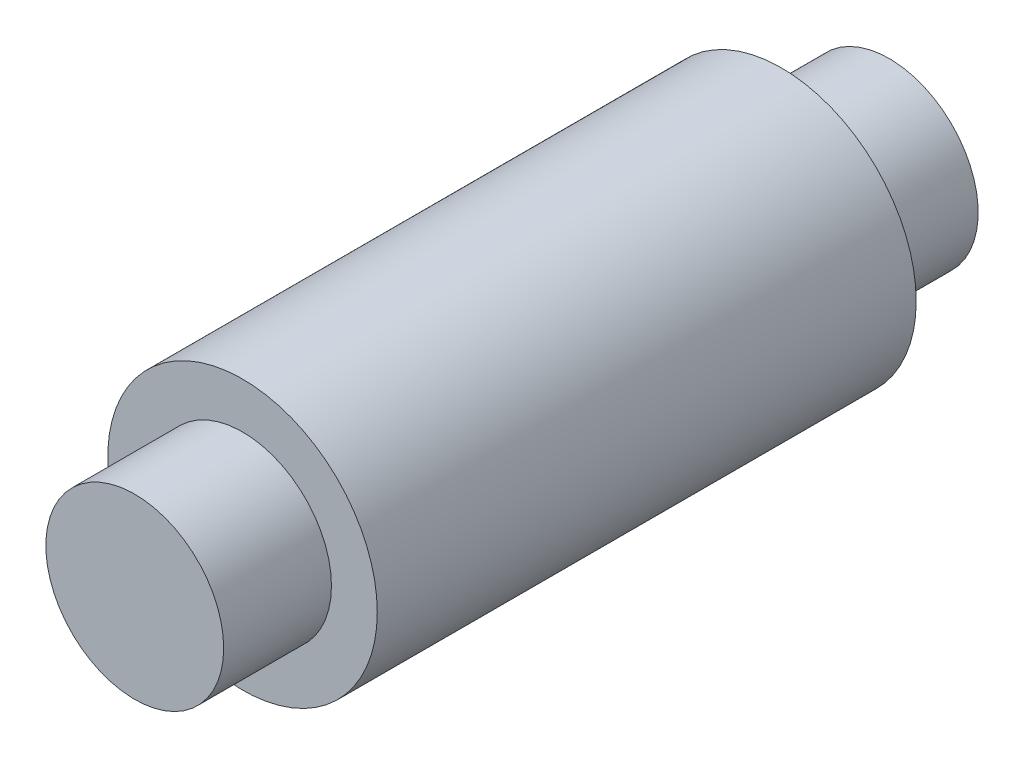
ISO-10303-21;
HEADER;
FILE_DESCRIPTION(('STEP AP214'),'2;1');
FILE_NAME('part.step','',(''),(''),'','','');
FILE_SCHEMA(('AUTOMOTIVE_DESIGN { 1 0 10303 214 1 1 1 1 }'));
ENDSEC;
DATA;
#1=APPLICATION_CONTEXT('core data for automotive mechanical design processes');
#2=APPLICATION_PROTOCOL_DEFINITION('international standard','automotive_design',2000,#1);
#3=PRODUCT_CONTEXT('',#1,'mechanical');
#4=PRODUCT('Part','Part','',(#3));
#5=PRODUCT_RELATED_PRODUCT_CATEGORY('part','',(#4));
#6=PRODUCT_DEFINITION_FORMATION('','',#4);
#7=PRODUCT_DEFINITION_CONTEXT('part definition',#1,'design');
#8=PRODUCT_DEFINITION('design','',#6,#7);
#9=PRODUCT_DEFINITION_SHAPE('','',#8);
#10=(LENGTH_UNIT() NAMED_UNIT(*) SI_UNIT(.MILLI.,.METRE.));
#11=(NAMED_UNIT(*) PLANE_ANGLE_UNIT() SI_UNIT($,.RADIAN.));
#12=(NAMED_UNIT(*) SI_UNIT($,.STERADIAN.) SOLID_ANGLE_UNIT());
#13=UNCERTAINTY_MEASURE_WITH_UNIT(LENGTH_MEASURE(1.E-05),#10,'distance_accuracy_value','');
#14=(GEOMETRIC_REPRESENTATION_CONTEXT(3) GLOBAL_UNCERTAINTY_ASSIGNED_CONTEXT((#13)) GLOBAL_UNIT_ASSIGNED_CONTEXT((#10,
#11,#12)) REPRESENTATION_CONTEXT('',''));
#15=CARTESIAN_POINT('',(0.,0.,0.));
#16=DIRECTION('',(0.,0.,1.));
#17=DIRECTION('',(1.,0.,0.));
#18=AXIS2_PLACEMENT_3D('',#15,#16,#17);
#19=CARTESIAN_POINT('',(0.,0.,10.));
#20=DIRECTION('',(0.,0.,-1.));
#21=DIRECTION('',(-1.,0.,0.));
#22=AXIS2_PLACEMENT_3D('',#19,#20,#21);
#23=CYLINDRICAL_SURFACE('',#22,2.5);
#24=CARTESIAN_POINT('',(0.,0.,10.));
#25=DIRECTION('',(0.,0.,1.));
#26=DIRECTION('',(1.,0.,0.));
#27=AXIS2_PLACEMENT_3D('',#24,#25,#26);
#28=CIRCLE('',#27,2.5);
#29=CARTESIAN_POINT('',(2.5,0.,10.));
#30=VERTEX_POINT('',#29);
#31=EDGE_CURVE('E46',#30,#30,#28,.T.);
#32=ORIENTED_EDGE('',*,*,#31,.F.);
#33=EDGE_LOOP('',(#32));
#34=FACE_BOUND('',#33,.T.);
#35=CARTESIAN_POINT('',(0.,0.,0.));
#36=DIRECTION('',(0.,0.,1.));
#37=DIRECTION('',(1.,0.,0.));
#38=AXIS2_PLACEMENT_3D('',#35,#36,#37);
#39=CIRCLE('',#38,2.5);
#40=CARTESIAN_POINT('',(2.5,0.,0.));
#41=VERTEX_POINT('',#40);
#42=EDGE_CURVE('E37',#41,#41,#39,.T.);
#43=ORIENTED_EDGE('',*,*,#42,.T.);
#44=EDGE_LOOP('',(#43));
#45=FACE_BOUND('',#44,.T.);
#46=ADVANCED_FACE('F34',(#34,#45),#23,.T.);
#47=CARTESIAN_POINT('',(0.,0.,10.));
#48=DIRECTION('',(0.,0.,1.));
#49=DIRECTION('',(1.,0.,0.));
#50=AXIS2_PLACEMENT_3D('',#47,#48,#49);
#51=PLANE('',#50);
#52=CARTESIAN_POINT('',(0.,0.,10.));
#53=DIRECTION('',(0.,0.,1.));
#54=DIRECTION('',(1.,0.,0.));
#55=AXIS2_PLACEMENT_3D('',#52,#53,#54);
#56=CIRCLE('',#55,1.65);
#57=CARTESIAN_POINT('',(1.65,0.,10.));
#58=VERTEX_POINT('',#57);
#59=EDGE_CURVE('E41',#58,#58,#56,.T.);
#60=ORIENTED_EDGE('',*,*,#59,.F.);
#61=EDGE_LOOP('',(#60));
#62=FACE_BOUND('',#61,.T.);
#63=ORIENTED_EDGE('',*,*,#31,.T.);
#64=EDGE_LOOP('',(#63));
#65=FACE_BOUND('',#64,.T.);
#66=ADVANCED_FACE('F63',(#62,#65),#51,.T.);
#67=CARTESIAN_POINT('',(0.,0.,0.));
#68=DIRECTION('',(0.,0.,1.));
#69=DIRECTION('',(1.,0.,0.));
#70=AXIS2_PLACEMENT_3D('',#67,#68,#69);
#71=PLANE('',#70);
#72=CARTESIAN_POINT('',(0.,0.,0.));
#73=DIRECTION('',(0.,0.,-1.));
#74=DIRECTION('',(-1.,0.,0.));
#75=AXIS2_PLACEMENT_3D('',#72,#73,#74);
#76=CIRCLE('',#75,1.65);
#77=CARTESIAN_POINT('',(-1.65,0.,0.));
#78=VERTEX_POINT('',#77);
#79=EDGE_CURVE('E10',#78,#78,#76,.T.);
#80=ORIENTED_EDGE('',*,*,#79,.F.);
#81=EDGE_LOOP('',(#80));
#82=FACE_BOUND('',#81,.T.);
#83=ORIENTED_EDGE('',*,*,#42,.F.);
#84=EDGE_LOOP('',(#83));
#85=FACE_BOUND('',#84,.T.);
#86=ADVANCED_FACE('F60',(#82,#85),#71,.F.);
#87=CARTESIAN_POINT('',(0.,0.,12.));
#88=DIRECTION('',(0.,0.,-1.));
#89=DIRECTION('',(-1.,0.,0.));
#90=AXIS2_PLACEMENT_3D('',#87,#88,#89);
#91=CYLINDRICAL_SURFACE('',#90,1.65);
#92=CARTESIAN_POINT('',(0.,0.,12.));
#93=DIRECTION('',(0.,0.,1.));
#94=DIRECTION('',(1.,0.,0.));
#95=AXIS2_PLACEMENT_3D('',#92,#93,#94);
#96=CIRCLE('',#95,1.65);
#97=CARTESIAN_POINT('',(1.65,0.,12.));
#98=VERTEX_POINT('',#97);
#99=EDGE_CURVE('E51',#98,#98,#96,.T.);
#100=ORIENTED_EDGE('',*,*,#99,.F.);
#101=EDGE_LOOP('',(#100));
#102=FACE_BOUND('',#101,.T.);
#103=ORIENTED_EDGE('',*,*,#59,.T.);
#104=EDGE_LOOP('',(#103));
#105=FACE_BOUND('',#104,.T.);
#106=ADVANCED_FACE('F62',(#102,#105),#91,.T.);
#107=CARTESIAN_POINT('',(0.,0.,12.));
#108=DIRECTION('',(0.,0.,1.));
#109=DIRECTION('',(1.,0.,0.));
#110=AXIS2_PLACEMENT_3D('',#107,#108,#109);
#111=PLANE('',#110);
#112=ORIENTED_EDGE('',*,*,#99,.T.);
#113=EDGE_LOOP('',(#112));
#114=FACE_BOUND('',#113,.T.);
#115=ADVANCED_FACE('F69',(#114),#111,.T.);
#116=CARTESIAN_POINT('',(0.,0.,-2.));
#117=DIRECTION('',(0.,0.,1.));
#118=DIRECTION('',(1.,0.,0.));
#119=AXIS2_PLACEMENT_3D('',#116,#117,#118);
#120=CYLINDRICAL_SURFACE('',#119,1.65);
#121=CARTESIAN_POINT('',(0.,0.,-2.));
#122=DIRECTION('',(0.,0.,-1.));
#123=DIRECTION('',(-1.,0.,0.));
#124=AXIS2_PLACEMENT_3D('',#121,#122,#123);
#125=CIRCLE('',#124,1.65);
#126=CARTESIAN_POINT('',(-1.65,0.,-2.));
#127=VERTEX_POINT('',#126);
#128=EDGE_CURVE('E50',#127,#127,#125,.T.);
#129=ORIENTED_EDGE('',*,*,#128,.F.);
#130=EDGE_LOOP('',(#129));
#131=FACE_BOUND('',#130,.T.);
#132=ORIENTED_EDGE('',*,*,#79,.T.);
#133=EDGE_LOOP('',(#132));
#134=FACE_BOUND('',#133,.T.);
#135=ADVANCED_FACE('F97',(#131,#134),#120,.T.);
#136=CARTESIAN_POINT('',(0.,0.,-2.));
#137=DIRECTION('',(0.,0.,-1.));
#138=DIRECTION('',(-1.,0.,0.));
#139=AXIS2_PLACEMENT_3D('',#136,#137,#138);
#140=PLANE('',#139);
#141=ORIENTED_EDGE('',*,*,#128,.T.);
#142=EDGE_LOOP('',(#141));
#143=FACE_BOUND('',#142,.T.);
#144=ADVANCED_FACE('F111',(#143),#140,.T.);
#145=CLOSED_SHELL('',(#46,#66,#86,#106,#115,#135,#144));
#146=MANIFOLD_SOLID_BREP('B2',#145);
#147=ADVANCED_BREP_SHAPE_REPRESENTATION('',(#18,#146),#14);
#148=SHAPE_DEFINITION_REPRESENTATION(#9,#147);
ENDSEC;
END-ISO-10303-21;
